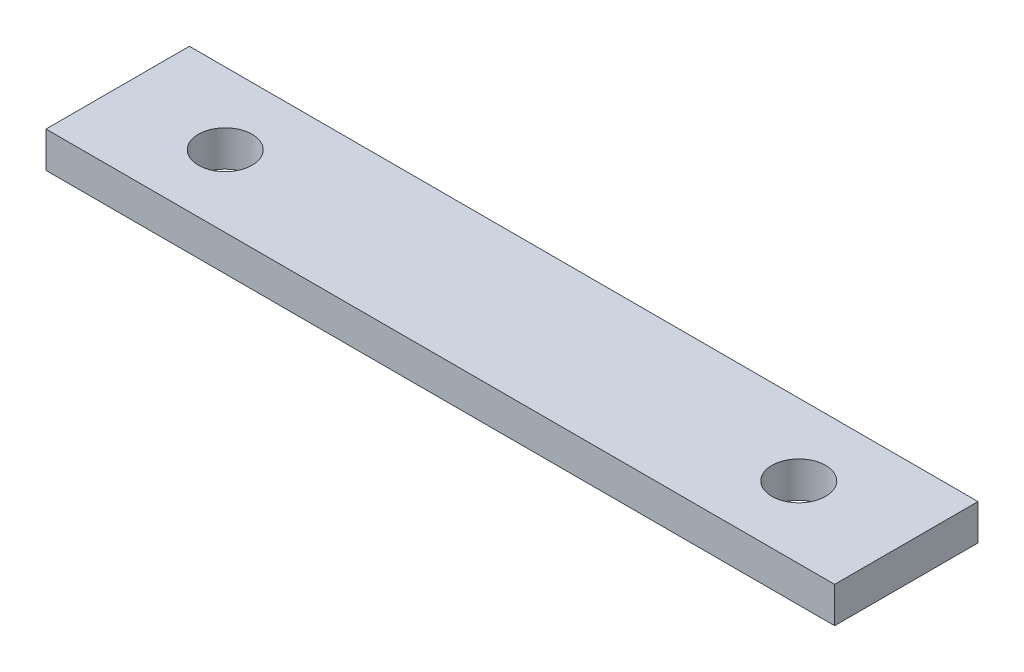
ISO-10303-21;
HEADER;
FILE_DESCRIPTION(('STEP AP214'),'2;1');
FILE_NAME('part.step','',(''),(''),'','','');
FILE_SCHEMA(('AUTOMOTIVE_DESIGN { 1 0 10303 214 1 1 1 1 }'));
ENDSEC;
DATA;
#1=APPLICATION_CONTEXT('core data for automotive mechanical design processes');
#2=APPLICATION_PROTOCOL_DEFINITION('international standard','automotive_design',2000,#1);
#3=PRODUCT_CONTEXT('',#1,'mechanical');
#4=PRODUCT('Part','Part','',(#3));
#5=PRODUCT_RELATED_PRODUCT_CATEGORY('part','',(#4));
#6=PRODUCT_DEFINITION_FORMATION('','',#4);
#7=PRODUCT_DEFINITION_CONTEXT('part definition',#1,'design');
#8=PRODUCT_DEFINITION('design','',#6,#7);
#9=PRODUCT_DEFINITION_SHAPE('','',#8);
#10=(LENGTH_UNIT() NAMED_UNIT(*) SI_UNIT(.MILLI.,.METRE.));
#11=(NAMED_UNIT(*) PLANE_ANGLE_UNIT() SI_UNIT($,.RADIAN.));
#12=(NAMED_UNIT(*) SI_UNIT($,.STERADIAN.) SOLID_ANGLE_UNIT());
#13=UNCERTAINTY_MEASURE_WITH_UNIT(LENGTH_MEASURE(1.E-05),#10,'distance_accuracy_value','');
#14=(GEOMETRIC_REPRESENTATION_CONTEXT(3) GLOBAL_UNCERTAINTY_ASSIGNED_CONTEXT((#13)) GLOBAL_UNIT_ASSIGNED_CONTEXT((#10,
#11,#12)) REPRESENTATION_CONTEXT('',''));
#15=CARTESIAN_POINT('',(0.,0.,0.));
#16=DIRECTION('',(0.,0.,1.));
#17=DIRECTION('',(1.,0.,0.));
#18=AXIS2_PLACEMENT_3D('',#15,#16,#17);
#19=CARTESIAN_POINT('',(69.85,3.175,-12.7));
#20=DIRECTION('',(-1.,0.,0.));
#21=DIRECTION('',(0.,0.,1.));
#22=AXIS2_PLACEMENT_3D('',#19,#20,#21);
#23=PLANE('',#22);
#24=DIRECTION('',(0.,0.,-1.));
#25=VECTOR('',#24,1.);
#26=CARTESIAN_POINT('',(69.85,-3.175,-12.7));
#27=LINE('',#26,#25);
#28=CARTESIAN_POINT('',(69.85,-3.175,12.7));
#29=VERTEX_POINT('',#28);
#30=CARTESIAN_POINT('',(69.85,-3.175,-12.7));
#31=VERTEX_POINT('',#30);
#32=EDGE_CURVE('E97',#29,#31,#27,.T.);
#33=ORIENTED_EDGE('',*,*,#32,.T.);
#34=DIRECTION('',(0.,-1.,0.));
#35=VECTOR('',#34,1.);
#36=CARTESIAN_POINT('',(69.85,3.175,-12.7));
#37=LINE('',#36,#35);
#38=CARTESIAN_POINT('',(69.85,3.175,-12.7));
#39=VERTEX_POINT('',#38);
#40=EDGE_CURVE('E11',#39,#31,#37,.T.);
#41=ORIENTED_EDGE('',*,*,#40,.F.);
#42=DIRECTION('',(0.,0.,-1.));
#43=VECTOR('',#42,1.);
#44=CARTESIAN_POINT('',(69.85,3.175,-12.7));
#45=LINE('',#44,#43);
#46=CARTESIAN_POINT('',(69.85,3.175,12.7));
#47=VERTEX_POINT('',#46);
#48=EDGE_CURVE('E85',#47,#39,#45,.T.);
#49=ORIENTED_EDGE('',*,*,#48,.F.);
#50=DIRECTION('',(0.,-1.,0.));
#51=VECTOR('',#50,1.);
#52=CARTESIAN_POINT('',(69.85,3.175,12.7));
#53=LINE('',#52,#51);
#54=EDGE_CURVE('E93',#47,#29,#53,.T.);
#55=ORIENTED_EDGE('',*,*,#54,.T.);
#56=EDGE_LOOP('',(#33,#41,#49,#55));
#57=FACE_BOUND('',#56,.T.);
#58=ADVANCED_FACE('F34',(#57),#23,.F.);
#59=CARTESIAN_POINT('',(-69.85,3.175,-12.7));
#60=DIRECTION('',(0.,0.,1.));
#61=DIRECTION('',(1.,0.,0.));
#62=AXIS2_PLACEMENT_3D('',#59,#60,#61);
#63=PLANE('',#62);
#64=DIRECTION('',(-1.,0.,0.));
#65=VECTOR('',#64,1.);
#66=CARTESIAN_POINT('',(-69.85,-3.175,-12.7));
#67=LINE('',#66,#65);
#68=CARTESIAN_POINT('',(-69.85,-3.175,-12.7));
#69=VERTEX_POINT('',#68);
#70=EDGE_CURVE('E89',#31,#69,#67,.T.);
#71=ORIENTED_EDGE('',*,*,#70,.T.);
#72=DIRECTION('',(0.,-1.,0.));
#73=VECTOR('',#72,1.);
#74=CARTESIAN_POINT('',(-69.85,3.175,-12.7));
#75=LINE('',#74,#73);
#76=CARTESIAN_POINT('',(-69.85,3.175,-12.7));
#77=VERTEX_POINT('',#76);
#78=EDGE_CURVE('E42',#77,#69,#75,.T.);
#79=ORIENTED_EDGE('',*,*,#78,.F.);
#80=DIRECTION('',(-1.,0.,0.));
#81=VECTOR('',#80,1.);
#82=CARTESIAN_POINT('',(-69.85,3.175,-12.7));
#83=LINE('',#82,#81);
#84=EDGE_CURVE('E80',#39,#77,#83,.T.);
#85=ORIENTED_EDGE('',*,*,#84,.F.);
#86=ORIENTED_EDGE('',*,*,#40,.T.);
#87=EDGE_LOOP('',(#71,#79,#85,#86));
#88=FACE_BOUND('',#87,.T.);
#89=ADVANCED_FACE('F88',(#88),#63,.F.);
#90=CARTESIAN_POINT('',(-69.85,3.175,-12.7));
#91=DIRECTION('',(1.,0.,0.));
#92=DIRECTION('',(0.,0.,-1.));
#93=AXIS2_PLACEMENT_3D('',#90,#91,#92);
#94=PLANE('',#93);
#95=DIRECTION('',(0.,0.,1.));
#96=VECTOR('',#95,1.);
#97=CARTESIAN_POINT('',(-69.85,-3.175,-12.7));
#98=LINE('',#97,#96);
#99=CARTESIAN_POINT('',(-69.85,-3.175,12.7));
#100=VERTEX_POINT('',#99);
#101=EDGE_CURVE('E67',#69,#100,#98,.T.);
#102=ORIENTED_EDGE('',*,*,#101,.T.);
#103=DIRECTION('',(0.,-1.,0.));
#104=VECTOR('',#103,1.);
#105=CARTESIAN_POINT('',(-69.85,3.175,12.7));
#106=LINE('',#105,#104);
#107=CARTESIAN_POINT('',(-69.85,3.175,12.7));
#108=VERTEX_POINT('',#107);
#109=EDGE_CURVE('E90',#108,#100,#106,.T.);
#110=ORIENTED_EDGE('',*,*,#109,.F.);
#111=DIRECTION('',(0.,0.,1.));
#112=VECTOR('',#111,1.);
#113=CARTESIAN_POINT('',(-69.85,3.175,-12.7));
#114=LINE('',#113,#112);
#115=EDGE_CURVE('E83',#77,#108,#114,.T.);
#116=ORIENTED_EDGE('',*,*,#115,.F.);
#117=ORIENTED_EDGE('',*,*,#78,.T.);
#118=EDGE_LOOP('',(#102,#110,#116,#117));
#119=FACE_BOUND('',#118,.T.);
#120=ADVANCED_FACE('F91',(#119),#94,.F.);
#121=CARTESIAN_POINT('',(-69.85,3.175,12.7));
#122=DIRECTION('',(0.,0.,-1.));
#123=DIRECTION('',(-1.,0.,0.));
#124=AXIS2_PLACEMENT_3D('',#121,#122,#123);
#125=PLANE('',#124);
#126=DIRECTION('',(1.,0.,0.));
#127=VECTOR('',#126,1.);
#128=CARTESIAN_POINT('',(-69.85,-3.175,12.7));
#129=LINE('',#128,#127);
#130=EDGE_CURVE('E73',#100,#29,#129,.T.);
#131=ORIENTED_EDGE('',*,*,#130,.T.);
#132=ORIENTED_EDGE('',*,*,#54,.F.);
#133=DIRECTION('',(1.,0.,0.));
#134=VECTOR('',#133,1.);
#135=CARTESIAN_POINT('',(-69.85,3.175,12.7));
#136=LINE('',#135,#134);
#137=EDGE_CURVE('E50',#108,#47,#136,.T.);
#138=ORIENTED_EDGE('',*,*,#137,.F.);
#139=ORIENTED_EDGE('',*,*,#109,.T.);
#140=EDGE_LOOP('',(#131,#132,#138,#139));
#141=FACE_BOUND('',#140,.T.);
#142=ADVANCED_FACE('F105',(#141),#125,.F.);
#143=CARTESIAN_POINT('',(69.85,3.175,12.7));
#144=DIRECTION('',(0.,1.,0.));
#145=DIRECTION('',(0.,0.,1.));
#146=AXIS2_PLACEMENT_3D('',#143,#144,#145);
#147=PLANE('',#146);
#148=CARTESIAN_POINT('',(-50.8,3.175,0.));
#149=DIRECTION('',(0.,1.,0.));
#150=DIRECTION('',(0.,0.,1.));
#151=AXIS2_PLACEMENT_3D('',#148,#149,#150);
#152=CIRCLE('',#151,4.7625);
#153=CARTESIAN_POINT('',(-50.8,3.175,4.7625));
#154=VERTEX_POINT('',#153);
#155=EDGE_CURVE('E114',#154,#154,#152,.T.);
#156=ORIENTED_EDGE('',*,*,#155,.F.);
#157=EDGE_LOOP('',(#156));
#158=FACE_BOUND('',#157,.T.);
#159=CARTESIAN_POINT('',(50.8,3.175,0.));
#160=DIRECTION('',(0.,1.,0.));
#161=DIRECTION('',(0.,0.,1.));
#162=AXIS2_PLACEMENT_3D('',#159,#160,#161);
#163=CIRCLE('',#162,4.7625);
#164=CARTESIAN_POINT('',(50.8,3.175,4.7625));
#165=VERTEX_POINT('',#164);
#166=EDGE_CURVE('E111',#165,#165,#163,.T.);
#167=ORIENTED_EDGE('',*,*,#166,.F.);
#168=EDGE_LOOP('',(#167));
#169=FACE_BOUND('',#168,.T.);
#170=ORIENTED_EDGE('',*,*,#48,.T.);
#171=ORIENTED_EDGE('',*,*,#84,.T.);
#172=ORIENTED_EDGE('',*,*,#115,.T.);
#173=ORIENTED_EDGE('',*,*,#137,.T.);
#174=EDGE_LOOP('',(#170,#171,#172,#173));
#175=FACE_BOUND('',#174,.T.);
#176=ADVANCED_FACE('F81',(#158,#169,#175),#147,.T.);
#177=CARTESIAN_POINT('',(69.85,-3.175,12.7));
#178=DIRECTION('',(0.,1.,0.));
#179=DIRECTION('',(0.,0.,1.));
#180=AXIS2_PLACEMENT_3D('',#177,#178,#179);
#181=PLANE('',#180);
#182=CARTESIAN_POINT('',(-50.8,-3.175,0.));
#183=DIRECTION('',(0.,1.,0.));
#184=DIRECTION('',(0.,0.,1.));
#185=AXIS2_PLACEMENT_3D('',#182,#183,#184);
#186=CIRCLE('',#185,4.7625);
#187=CARTESIAN_POINT('',(-50.8,-3.175,4.7625));
#188=VERTEX_POINT('',#187);
#189=EDGE_CURVE('E117',#188,#188,#186,.T.);
#190=ORIENTED_EDGE('',*,*,#189,.T.);
#191=EDGE_LOOP('',(#190));
#192=FACE_BOUND('',#191,.T.);
#193=CARTESIAN_POINT('',(50.8,-3.175,0.));
#194=DIRECTION('',(0.,1.,0.));
#195=DIRECTION('',(0.,0.,1.));
#196=AXIS2_PLACEMENT_3D('',#193,#194,#195);
#197=CIRCLE('',#196,4.7625);
#198=CARTESIAN_POINT('',(50.8,-3.175,4.7625));
#199=VERTEX_POINT('',#198);
#200=EDGE_CURVE('E100',#199,#199,#197,.T.);
#201=ORIENTED_EDGE('',*,*,#200,.T.);
#202=EDGE_LOOP('',(#201));
#203=FACE_BOUND('',#202,.T.);
#204=ORIENTED_EDGE('',*,*,#32,.F.);
#205=ORIENTED_EDGE('',*,*,#130,.F.);
#206=ORIENTED_EDGE('',*,*,#101,.F.);
#207=ORIENTED_EDGE('',*,*,#70,.F.);
#208=EDGE_LOOP('',(#204,#205,#206,#207));
#209=FACE_BOUND('',#208,.T.);
#210=ADVANCED_FACE('F108',(#192,#203,#209),#181,.F.);
#211=CARTESIAN_POINT('',(50.8,-3.175,0.));
#212=DIRECTION('',(0.,1.,0.));
#213=DIRECTION('',(0.,0.,1.));
#214=AXIS2_PLACEMENT_3D('',#211,#212,#213);
#215=CYLINDRICAL_SURFACE('',#214,4.7625);
#216=ORIENTED_EDGE('',*,*,#200,.F.);
#217=EDGE_LOOP('',(#216));
#218=FACE_BOUND('',#217,.T.);
#219=ORIENTED_EDGE('',*,*,#166,.T.);
#220=EDGE_LOOP('',(#219));
#221=FACE_BOUND('',#220,.T.);
#222=ADVANCED_FACE('F130',(#218,#221),#215,.F.);
#223=CARTESIAN_POINT('',(-50.8,-3.175,0.));
#224=DIRECTION('',(0.,1.,0.));
#225=DIRECTION('',(0.,0.,1.));
#226=AXIS2_PLACEMENT_3D('',#223,#224,#225);
#227=CYLINDRICAL_SURFACE('',#226,4.7625);
#228=ORIENTED_EDGE('',*,*,#189,.F.);
#229=EDGE_LOOP('',(#228));
#230=FACE_BOUND('',#229,.T.);
#231=ORIENTED_EDGE('',*,*,#155,.T.);
#232=EDGE_LOOP('',(#231));
#233=FACE_BOUND('',#232,.T.);
#234=ADVANCED_FACE('F123',(#230,#233),#227,.F.);
#235=CLOSED_SHELL('',(#58,#89,#120,#142,#176,#210,#222,#234));
#236=MANIFOLD_SOLID_BREP('B2',#235);
#237=ADVANCED_BREP_SHAPE_REPRESENTATION('',(#18,#236),#14);
#238=SHAPE_DEFINITION_REPRESENTATION(#9,#237);
ENDSEC;
END-ISO-10303-21;
